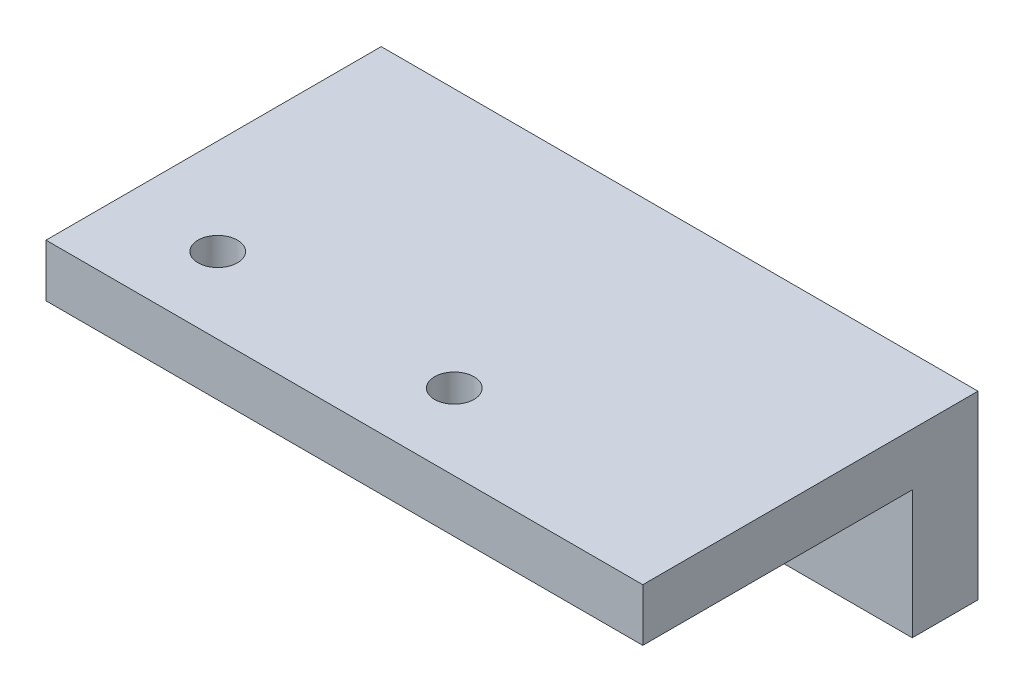
ISO-10303-21;
HEADER;
FILE_DESCRIPTION(('STEP AP214'),'2;1');
FILE_NAME('part.step','',(''),(''),'','','');
FILE_SCHEMA(('AUTOMOTIVE_DESIGN { 1 0 10303 214 1 1 1 1 }'));
ENDSEC;
DATA;
#1=APPLICATION_CONTEXT('core data for automotive mechanical design processes');
#2=APPLICATION_PROTOCOL_DEFINITION('international standard','automotive_design',2000,#1);
#3=PRODUCT_CONTEXT('',#1,'mechanical');
#4=PRODUCT('Part','Part','',(#3));
#5=PRODUCT_RELATED_PRODUCT_CATEGORY('part','',(#4));
#6=PRODUCT_DEFINITION_FORMATION('','',#4);
#7=PRODUCT_DEFINITION_CONTEXT('part definition',#1,'design');
#8=PRODUCT_DEFINITION('design','',#6,#7);
#9=PRODUCT_DEFINITION_SHAPE('','',#8);
#10=(LENGTH_UNIT() NAMED_UNIT(*) SI_UNIT(.MILLI.,.METRE.));
#11=(NAMED_UNIT(*) PLANE_ANGLE_UNIT() SI_UNIT($,.RADIAN.));
#12=(NAMED_UNIT(*) SI_UNIT($,.STERADIAN.) SOLID_ANGLE_UNIT());
#13=UNCERTAINTY_MEASURE_WITH_UNIT(LENGTH_MEASURE(1.E-05),#10,'distance_accuracy_value','');
#14=(GEOMETRIC_REPRESENTATION_CONTEXT(3) GLOBAL_UNCERTAINTY_ASSIGNED_CONTEXT((#13)) GLOBAL_UNIT_ASSIGNED_CONTEXT((#10,
#11,#12)) REPRESENTATION_CONTEXT('',''));
#15=CARTESIAN_POINT('',(0.,0.,0.));
#16=DIRECTION('',(0.,0.,1.));
#17=DIRECTION('',(1.,0.,0.));
#18=AXIS2_PLACEMENT_3D('',#15,#16,#17);
#19=CARTESIAN_POINT('',(0.,4.,0.));
#20=DIRECTION('',(1.,0.,0.));
#21=DIRECTION('',(0.,0.,-1.));
#22=AXIS2_PLACEMENT_3D('',#19,#20,#21);
#23=PLANE('',#22);
#24=DIRECTION('',(0.,-1.,0.));
#25=VECTOR('',#24,1.);
#26=CARTESIAN_POINT('',(0.,4.,-25.5));
#27=LINE('',#26,#25);
#28=CARTESIAN_POINT('',(0.,4.,-25.5));
#29=VERTEX_POINT('',#28);
#30=CARTESIAN_POINT('',(0.,-9.75,-25.5));
#31=VERTEX_POINT('',#30);
#32=EDGE_CURVE('E146',#29,#31,#27,.T.);
#33=ORIENTED_EDGE('',*,*,#32,.T.);
#34=DIRECTION('',(0.,0.,-1.));
#35=VECTOR('',#34,1.);
#36=CARTESIAN_POINT('',(0.,-9.75,-25.5));
#37=LINE('',#36,#35);
#38=CARTESIAN_POINT('',(0.,-9.75,-20.5));
#39=VERTEX_POINT('',#38);
#40=EDGE_CURVE('E114',#39,#31,#37,.T.);
#41=ORIENTED_EDGE('',*,*,#40,.F.);
#42=DIRECTION('',(0.,1.,0.));
#43=VECTOR('',#42,1.);
#44=CARTESIAN_POINT('',(0.,-9.75,-20.5));
#45=LINE('',#44,#43);
#46=CARTESIAN_POINT('',(0.,0.,-20.5));
#47=VERTEX_POINT('',#46);
#48=EDGE_CURVE('E109',#39,#47,#45,.T.);
#49=ORIENTED_EDGE('',*,*,#48,.T.);
#50=DIRECTION('',(0.,0.,1.));
#51=VECTOR('',#50,1.);
#52=CARTESIAN_POINT('',(0.,0.,0.));
#53=LINE('',#52,#51);
#54=CARTESIAN_POINT('',(0.,0.,0.));
#55=VERTEX_POINT('',#54);
#56=EDGE_CURVE('E129',#47,#55,#53,.T.);
#57=ORIENTED_EDGE('',*,*,#56,.T.);
#58=DIRECTION('',(0.,-1.,0.));
#59=VECTOR('',#58,1.);
#60=CARTESIAN_POINT('',(0.,4.,0.));
#61=LINE('',#60,#59);
#62=CARTESIAN_POINT('',(0.,4.,0.));
#63=VERTEX_POINT('',#62);
#64=EDGE_CURVE('E11',#63,#55,#61,.T.);
#65=ORIENTED_EDGE('',*,*,#64,.F.);
#66=DIRECTION('',(0.,0.,1.));
#67=VECTOR('',#66,1.);
#68=CARTESIAN_POINT('',(0.,4.,0.));
#69=LINE('',#68,#67);
#70=EDGE_CURVE('E137',#29,#63,#69,.T.);
#71=ORIENTED_EDGE('',*,*,#70,.F.);
#72=EDGE_LOOP('',(#33,#41,#49,#57,#65,#71));
#73=FACE_BOUND('',#72,.T.);
#74=ADVANCED_FACE('F40',(#73),#23,.F.);
#75=CARTESIAN_POINT('',(0.,4.,0.));
#76=DIRECTION('',(0.,0.,-1.));
#77=DIRECTION('',(-1.,0.,0.));
#78=AXIS2_PLACEMENT_3D('',#75,#76,#77);
#79=PLANE('',#78);
#80=DIRECTION('',(1.,0.,0.));
#81=VECTOR('',#80,1.);
#82=CARTESIAN_POINT('',(0.,0.,0.));
#83=LINE('',#82,#81);
#84=CARTESIAN_POINT('',(45.4,0.,0.));
#85=VERTEX_POINT('',#84);
#86=EDGE_CURVE('E81',#55,#85,#83,.T.);
#87=ORIENTED_EDGE('',*,*,#86,.T.);
#88=DIRECTION('',(0.,-1.,0.));
#89=VECTOR('',#88,1.);
#90=CARTESIAN_POINT('',(45.4,4.,0.));
#91=LINE('',#90,#89);
#92=CARTESIAN_POINT('',(45.4,4.,0.));
#93=VERTEX_POINT('',#92);
#94=EDGE_CURVE('E49',#93,#85,#91,.T.);
#95=ORIENTED_EDGE('',*,*,#94,.F.);
#96=DIRECTION('',(1.,0.,0.));
#97=VECTOR('',#96,1.);
#98=CARTESIAN_POINT('',(0.,4.,0.));
#99=LINE('',#98,#97);
#100=EDGE_CURVE('E86',#63,#93,#99,.T.);
#101=ORIENTED_EDGE('',*,*,#100,.F.);
#102=ORIENTED_EDGE('',*,*,#64,.T.);
#103=EDGE_LOOP('',(#87,#95,#101,#102));
#104=FACE_BOUND('',#103,.T.);
#105=ADVANCED_FACE('F190',(#104),#79,.F.);
#106=CARTESIAN_POINT('',(45.4,4.,0.));
#107=DIRECTION('',(-1.,0.,0.));
#108=DIRECTION('',(0.,0.,1.));
#109=AXIS2_PLACEMENT_3D('',#106,#107,#108);
#110=PLANE('',#109);
#111=DIRECTION('',(0.,0.,-1.));
#112=VECTOR('',#111,1.);
#113=CARTESIAN_POINT('',(45.4,0.,0.));
#114=LINE('',#113,#112);
#115=CARTESIAN_POINT('',(45.4,0.,-20.5));
#116=VERTEX_POINT('',#115);
#117=EDGE_CURVE('E127',#85,#116,#114,.T.);
#118=ORIENTED_EDGE('',*,*,#117,.T.);
#119=DIRECTION('',(0.,1.,0.));
#120=VECTOR('',#119,1.);
#121=CARTESIAN_POINT('',(45.4,-9.75,-20.5));
#122=LINE('',#121,#120);
#123=CARTESIAN_POINT('',(45.4,-9.75,-20.5));
#124=VERTEX_POINT('',#123);
#125=EDGE_CURVE('E107',#124,#116,#122,.T.);
#126=ORIENTED_EDGE('',*,*,#125,.F.);
#127=DIRECTION('',(0.,0.,1.));
#128=VECTOR('',#127,1.);
#129=CARTESIAN_POINT('',(45.4,-9.75,-25.5));
#130=LINE('',#129,#128);
#131=CARTESIAN_POINT('',(45.4,-9.75,-25.5));
#132=VERTEX_POINT('',#131);
#133=EDGE_CURVE('E115',#132,#124,#130,.T.);
#134=ORIENTED_EDGE('',*,*,#133,.F.);
#135=DIRECTION('',(0.,-1.,0.));
#136=VECTOR('',#135,1.);
#137=CARTESIAN_POINT('',(45.4,4.,-25.5));
#138=LINE('',#137,#136);
#139=CARTESIAN_POINT('',(45.4,4.,-25.5));
#140=VERTEX_POINT('',#139);
#141=EDGE_CURVE('E154',#140,#132,#138,.T.);
#142=ORIENTED_EDGE('',*,*,#141,.F.);
#143=DIRECTION('',(0.,0.,-1.));
#144=VECTOR('',#143,1.);
#145=CARTESIAN_POINT('',(45.4,4.,0.));
#146=LINE('',#145,#144);
#147=EDGE_CURVE('E142',#93,#140,#146,.T.);
#148=ORIENTED_EDGE('',*,*,#147,.F.);
#149=ORIENTED_EDGE('',*,*,#94,.T.);
#150=EDGE_LOOP('',(#118,#126,#134,#142,#148,#149));
#151=FACE_BOUND('',#150,.T.);
#152=ADVANCED_FACE('F126',(#151),#110,.F.);
#153=CARTESIAN_POINT('',(0.,4.,-25.5));
#154=DIRECTION('',(0.,0.,1.));
#155=DIRECTION('',(1.,0.,0.));
#156=AXIS2_PLACEMENT_3D('',#153,#154,#155);
#157=PLANE('',#156);
#158=CARTESIAN_POINT('',(32.4000000000025,-4.88162837670833,-25.5));
#159=DIRECTION('',(0.,0.,1.));
#160=DIRECTION('',(1.,0.,0.));
#161=AXIS2_PLACEMENT_3D('',#158,#159,#160);
#162=CIRCLE('',#161,1.65);
#163=CARTESIAN_POINT('',(34.0500000000025,-4.88162837670833,-25.5));
#164=VERTEX_POINT('',#163);
#165=EDGE_CURVE('E174',#164,#164,#162,.T.);
#166=ORIENTED_EDGE('',*,*,#165,.T.);
#167=EDGE_LOOP('',(#166));
#168=FACE_BOUND('',#167,.T.);
#169=CARTESIAN_POINT('',(13.0000000000025,-4.88162837670864,-25.5));
#170=DIRECTION('',(0.,0.,1.));
#171=DIRECTION('',(1.,0.,0.));
#172=AXIS2_PLACEMENT_3D('',#169,#170,#171);
#173=CIRCLE('',#172,1.65);
#174=CARTESIAN_POINT('',(14.6500000000025,-4.88162837670864,-25.5));
#175=VERTEX_POINT('',#174);
#176=EDGE_CURVE('E236',#175,#175,#173,.T.);
#177=ORIENTED_EDGE('',*,*,#176,.T.);
#178=EDGE_LOOP('',(#177));
#179=FACE_BOUND('',#178,.T.);
#180=ORIENTED_EDGE('',*,*,#141,.T.);
#181=DIRECTION('',(1.,0.,0.));
#182=VECTOR('',#181,1.);
#183=CARTESIAN_POINT('',(45.4,-9.75,-25.5));
#184=LINE('',#183,#182);
#185=EDGE_CURVE('E121',#31,#132,#184,.T.);
#186=ORIENTED_EDGE('',*,*,#185,.F.);
#187=ORIENTED_EDGE('',*,*,#32,.F.);
#188=DIRECTION('',(-1.,0.,0.));
#189=VECTOR('',#188,1.);
#190=CARTESIAN_POINT('',(0.,4.,-25.5));
#191=LINE('',#190,#189);
#192=EDGE_CURVE('E66',#140,#29,#191,.T.);
#193=ORIENTED_EDGE('',*,*,#192,.F.);
#194=EDGE_LOOP('',(#180,#186,#187,#193));
#195=FACE_BOUND('',#194,.T.);
#196=ADVANCED_FACE('F187',(#168,#179,#195),#157,.F.);
#197=CARTESIAN_POINT('',(0.,4.,0.));
#198=DIRECTION('',(0.,-1.,0.));
#199=DIRECTION('',(0.,0.,-1.));
#200=AXIS2_PLACEMENT_3D('',#197,#198,#199);
#201=PLANE('',#200);
#202=CARTESIAN_POINT('',(7.27889500662138,4.,-5.78439094115357));
#203=DIRECTION('',(0.,1.,0.));
#204=DIRECTION('',(0.,0.,1.));
#205=AXIS2_PLACEMENT_3D('',#202,#203,#204);
#206=CIRCLE('',#205,1.5);
#207=CARTESIAN_POINT('',(7.27889500662138,4.,-4.28439094115357));
#208=VERTEX_POINT('',#207);
#209=EDGE_CURVE('E161',#208,#208,#206,.T.);
#210=ORIENTED_EDGE('',*,*,#209,.F.);
#211=EDGE_LOOP('',(#210));
#212=FACE_BOUND('',#211,.T.);
#213=CARTESIAN_POINT('',(25.2770135772518,4.,-5.78270568334592));
#214=DIRECTION('',(0.,1.,0.));
#215=DIRECTION('',(0.,0.,1.));
#216=AXIS2_PLACEMENT_3D('',#213,#214,#215);
#217=CIRCLE('',#216,1.5);
#218=CARTESIAN_POINT('',(25.2770135772518,4.,-4.28270568334592));
#219=VERTEX_POINT('',#218);
#220=EDGE_CURVE('E168',#219,#219,#217,.T.);
#221=ORIENTED_EDGE('',*,*,#220,.F.);
#222=EDGE_LOOP('',(#221));
#223=FACE_BOUND('',#222,.T.);
#224=ORIENTED_EDGE('',*,*,#70,.T.);
#225=ORIENTED_EDGE('',*,*,#100,.T.);
#226=ORIENTED_EDGE('',*,*,#147,.T.);
#227=ORIENTED_EDGE('',*,*,#192,.T.);
#228=EDGE_LOOP('',(#224,#225,#226,#227));
#229=FACE_BOUND('',#228,.T.);
#230=ADVANCED_FACE('F189',(#212,#223,#229),#201,.F.);
#231=CARTESIAN_POINT('',(0.,0.,0.));
#232=DIRECTION('',(0.,-1.,0.));
#233=DIRECTION('',(0.,0.,-1.));
#234=AXIS2_PLACEMENT_3D('',#231,#232,#233);
#235=PLANE('',#234);
#236=CARTESIAN_POINT('',(7.27889500662138,0.,-5.78439094115357));
#237=DIRECTION('',(0.,-1.,0.));
#238=DIRECTION('',(0.,0.,-1.));
#239=AXIS2_PLACEMENT_3D('',#236,#237,#238);
#240=CIRCLE('',#239,1.5);
#241=CARTESIAN_POINT('',(7.27889500662138,0.,-7.28439094115357));
#242=VERTEX_POINT('',#241);
#243=EDGE_CURVE('E43',#242,#242,#240,.T.);
#244=ORIENTED_EDGE('',*,*,#243,.F.);
#245=EDGE_LOOP('',(#244));
#246=FACE_BOUND('',#245,.T.);
#247=CARTESIAN_POINT('',(25.2770135772518,0.,-5.78270568334592));
#248=DIRECTION('',(0.,-1.,0.));
#249=DIRECTION('',(0.,0.,-1.));
#250=AXIS2_PLACEMENT_3D('',#247,#248,#249);
#251=CIRCLE('',#250,1.5);
#252=CARTESIAN_POINT('',(25.2770135772518,0.,-7.28270568334592));
#253=VERTEX_POINT('',#252);
#254=EDGE_CURVE('E158',#253,#253,#251,.T.);
#255=ORIENTED_EDGE('',*,*,#254,.F.);
#256=EDGE_LOOP('',(#255));
#257=FACE_BOUND('',#256,.T.);
#258=DIRECTION('',(-1.,0.,0.));
#259=VECTOR('',#258,1.);
#260=CARTESIAN_POINT('',(45.4,0.,-20.5));
#261=LINE('',#260,#259);
#262=EDGE_CURVE('E57',#116,#47,#261,.T.);
#263=ORIENTED_EDGE('',*,*,#262,.F.);
#264=ORIENTED_EDGE('',*,*,#117,.F.);
#265=ORIENTED_EDGE('',*,*,#86,.F.);
#266=ORIENTED_EDGE('',*,*,#56,.F.);
#267=EDGE_LOOP('',(#263,#264,#265,#266));
#268=FACE_BOUND('',#267,.T.);
#269=ADVANCED_FACE('F201',(#246,#257,#268),#235,.T.);
#270=CARTESIAN_POINT('',(45.4,-9.75,-20.5));
#271=DIRECTION('',(0.,0.,-1.));
#272=DIRECTION('',(-1.,0.,0.));
#273=AXIS2_PLACEMENT_3D('',#270,#271,#272);
#274=PLANE('',#273);
#275=CARTESIAN_POINT('',(32.4000000000025,-4.88162837670833,-20.5));
#276=DIRECTION('',(0.,0.,1.));
#277=DIRECTION('',(1.,0.,0.));
#278=AXIS2_PLACEMENT_3D('',#275,#276,#277);
#279=CIRCLE('',#278,1.65);
#280=CARTESIAN_POINT('',(34.0500000000025,-4.88162837670833,-20.5));
#281=VERTEX_POINT('',#280);
#282=EDGE_CURVE('E232',#281,#281,#279,.T.);
#283=ORIENTED_EDGE('',*,*,#282,.F.);
#284=EDGE_LOOP('',(#283));
#285=FACE_BOUND('',#284,.T.);
#286=CARTESIAN_POINT('',(13.0000000000025,-4.88162837670864,-20.5));
#287=DIRECTION('',(0.,0.,1.));
#288=DIRECTION('',(1.,0.,0.));
#289=AXIS2_PLACEMENT_3D('',#286,#287,#288);
#290=CIRCLE('',#289,1.65);
#291=CARTESIAN_POINT('',(14.6500000000025,-4.88162837670864,-20.5));
#292=VERTEX_POINT('',#291);
#293=EDGE_CURVE('E242',#292,#292,#290,.T.);
#294=ORIENTED_EDGE('',*,*,#293,.F.);
#295=EDGE_LOOP('',(#294));
#296=FACE_BOUND('',#295,.T.);
#297=ORIENTED_EDGE('',*,*,#262,.T.);
#298=ORIENTED_EDGE('',*,*,#48,.F.);
#299=DIRECTION('',(-1.,0.,0.));
#300=VECTOR('',#299,1.);
#301=CARTESIAN_POINT('',(45.4,-9.75,-20.5));
#302=LINE('',#301,#300);
#303=EDGE_CURVE('E103',#124,#39,#302,.T.);
#304=ORIENTED_EDGE('',*,*,#303,.F.);
#305=ORIENTED_EDGE('',*,*,#125,.T.);
#306=EDGE_LOOP('',(#297,#298,#304,#305));
#307=FACE_BOUND('',#306,.T.);
#308=ADVANCED_FACE('F105',(#285,#296,#307),#274,.F.);
#309=CARTESIAN_POINT('',(0.,-9.75,0.));
#310=DIRECTION('',(0.,-1.,0.));
#311=DIRECTION('',(0.,0.,-1.));
#312=AXIS2_PLACEMENT_3D('',#309,#310,#311);
#313=PLANE('',#312);
#314=ORIENTED_EDGE('',*,*,#133,.T.);
#315=ORIENTED_EDGE('',*,*,#303,.T.);
#316=ORIENTED_EDGE('',*,*,#40,.T.);
#317=ORIENTED_EDGE('',*,*,#185,.T.);
#318=EDGE_LOOP('',(#314,#315,#316,#317));
#319=FACE_BOUND('',#318,.T.);
#320=ADVANCED_FACE('F119',(#319),#313,.T.);
#321=CARTESIAN_POINT('',(25.2770135772518,-6.,-5.78270568334592));
#322=DIRECTION('',(0.,1.,0.));
#323=DIRECTION('',(0.,0.,1.));
#324=AXIS2_PLACEMENT_3D('',#321,#322,#323);
#325=CYLINDRICAL_SURFACE('',#324,1.5);
#326=ORIENTED_EDGE('',*,*,#254,.T.);
#327=EDGE_LOOP('',(#326));
#328=FACE_BOUND('',#327,.T.);
#329=ORIENTED_EDGE('',*,*,#220,.T.);
#330=EDGE_LOOP('',(#329));
#331=FACE_BOUND('',#330,.T.);
#332=ADVANCED_FACE('F213',(#328,#331),#325,.F.);
#333=CARTESIAN_POINT('',(7.27889500662138,-6.,-5.78439094115357));
#334=DIRECTION('',(0.,1.,0.));
#335=DIRECTION('',(0.,0.,1.));
#336=AXIS2_PLACEMENT_3D('',#333,#334,#335);
#337=CYLINDRICAL_SURFACE('',#336,1.5);
#338=ORIENTED_EDGE('',*,*,#243,.T.);
#339=EDGE_LOOP('',(#338));
#340=FACE_BOUND('',#339,.T.);
#341=ORIENTED_EDGE('',*,*,#209,.T.);
#342=EDGE_LOOP('',(#341));
#343=FACE_BOUND('',#342,.T.);
#344=ADVANCED_FACE('F216',(#340,#343),#337,.F.);
#345=CARTESIAN_POINT('',(13.0000000000025,-4.88162837670864,-30.5));
#346=DIRECTION('',(0.,0.,1.));
#347=DIRECTION('',(1.,0.,0.));
#348=AXIS2_PLACEMENT_3D('',#345,#346,#347);
#349=CYLINDRICAL_SURFACE('',#348,1.65);
#350=ORIENTED_EDGE('',*,*,#293,.T.);
#351=EDGE_LOOP('',(#350));
#352=FACE_BOUND('',#351,.T.);
#353=ORIENTED_EDGE('',*,*,#176,.F.);
#354=EDGE_LOOP('',(#353));
#355=FACE_BOUND('',#354,.T.);
#356=ADVANCED_FACE('F219',(#352,#355),#349,.F.);
#357=CARTESIAN_POINT('',(32.4000000000025,-4.88162837670833,-30.5));
#358=DIRECTION('',(0.,0.,1.));
#359=DIRECTION('',(1.,0.,0.));
#360=AXIS2_PLACEMENT_3D('',#357,#358,#359);
#361=CYLINDRICAL_SURFACE('',#360,1.65);
#362=ORIENTED_EDGE('',*,*,#282,.T.);
#363=EDGE_LOOP('',(#362));
#364=FACE_BOUND('',#363,.T.);
#365=ORIENTED_EDGE('',*,*,#165,.F.);
#366=EDGE_LOOP('',(#365));
#367=FACE_BOUND('',#366,.T.);
#368=ADVANCED_FACE('F223',(#364,#367),#361,.F.);
#369=CLOSED_SHELL('',(#74,#105,#152,#196,#230,#269,#308,#320,#332,#344,#356,#368));
#370=MANIFOLD_SOLID_BREP('B2',#369);
#371=ADVANCED_BREP_SHAPE_REPRESENTATION('',(#18,#370),#14);
#372=SHAPE_DEFINITION_REPRESENTATION(#9,#371);
ENDSEC;
END-ISO-10303-21;
